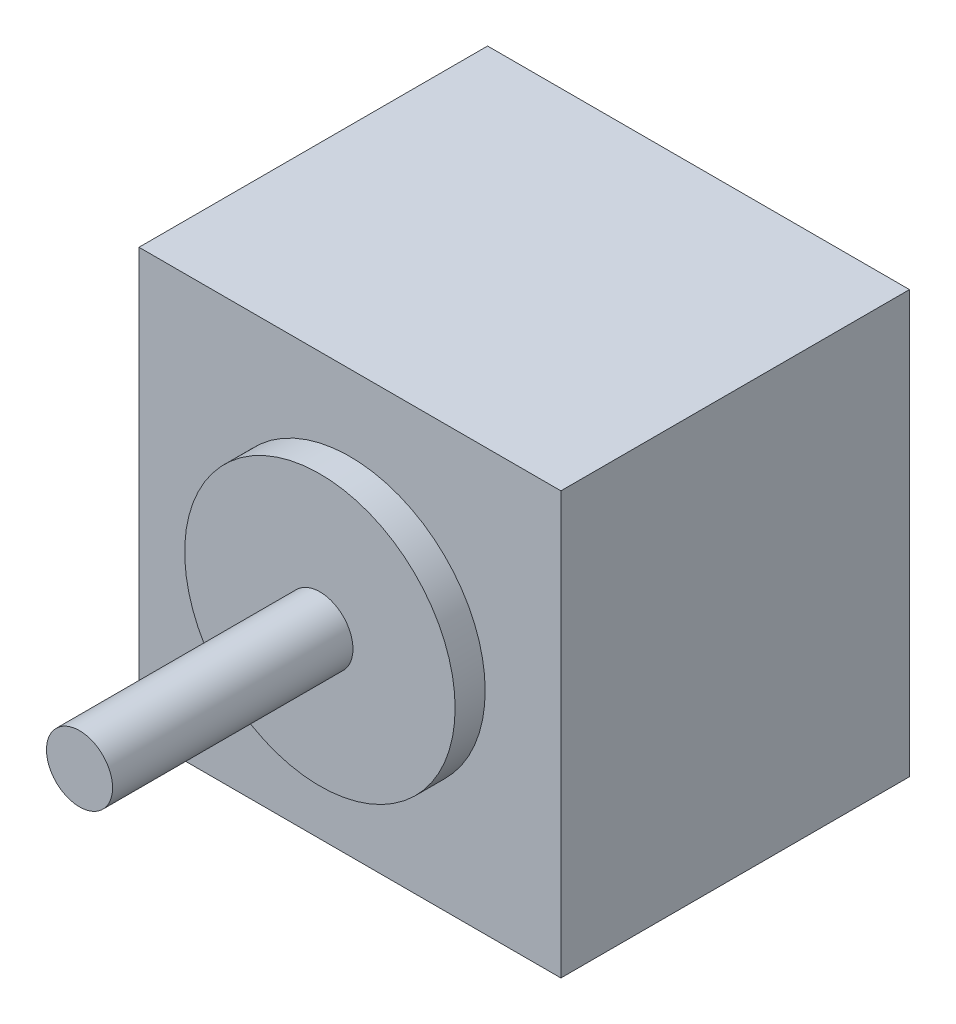
ISO-10303-21;
HEADER;
FILE_DESCRIPTION(('STEP AP214'),'2;1');
FILE_NAME('part.step','',(''),(''),'','','');
FILE_SCHEMA(('AUTOMOTIVE_DESIGN { 1 0 10303 214 1 1 1 1 }'));
ENDSEC;
DATA;
#1=APPLICATION_CONTEXT('core data for automotive mechanical design processes');
#2=APPLICATION_PROTOCOL_DEFINITION('international standard','automotive_design',2000,#1);
#3=PRODUCT_CONTEXT('',#1,'mechanical');
#4=PRODUCT('Part','Part','',(#3));
#5=PRODUCT_RELATED_PRODUCT_CATEGORY('part','',(#4));
#6=PRODUCT_DEFINITION_FORMATION('','',#4);
#7=PRODUCT_DEFINITION_CONTEXT('part definition',#1,'design');
#8=PRODUCT_DEFINITION('design','',#6,#7);
#9=PRODUCT_DEFINITION_SHAPE('','',#8);
#10=(LENGTH_UNIT() NAMED_UNIT(*) SI_UNIT(.MILLI.,.METRE.));
#11=(NAMED_UNIT(*) PLANE_ANGLE_UNIT() SI_UNIT($,.RADIAN.));
#12=(NAMED_UNIT(*) SI_UNIT($,.STERADIAN.) SOLID_ANGLE_UNIT());
#13=UNCERTAINTY_MEASURE_WITH_UNIT(LENGTH_MEASURE(1.E-05),#10,'distance_accuracy_value','');
#14=(GEOMETRIC_REPRESENTATION_CONTEXT(3) GLOBAL_UNCERTAINTY_ASSIGNED_CONTEXT((#13)) GLOBAL_UNIT_ASSIGNED_CONTEXT((#10,
#11,#12)) REPRESENTATION_CONTEXT('',''));
#15=CARTESIAN_POINT('',(0.,0.,0.));
#16=DIRECTION('',(0.,0.,1.));
#17=DIRECTION('',(1.,0.,0.));
#18=AXIS2_PLACEMENT_3D('',#15,#16,#17);
#19=CARTESIAN_POINT('',(-13.1625,8.55,29.));
#20=DIRECTION('',(1.,0.,0.));
#21=DIRECTION('',(0.,1.,0.));
#22=AXIS2_PLACEMENT_3D('',#19,#20,#21);
#23=PLANE('',#22);
#24=DIRECTION('',(0.,-1.,0.));
#25=VECTOR('',#24,1.);
#26=CARTESIAN_POINT('',(-13.1625,8.55,0.));
#27=LINE('',#26,#25);
#28=CARTESIAN_POINT('',(-13.1625,8.55,0.));
#29=VERTEX_POINT('',#28);
#30=CARTESIAN_POINT('',(-13.1625,-26.55,0.));
#31=VERTEX_POINT('',#30);
#32=EDGE_CURVE('E100',#29,#31,#27,.T.);
#33=ORIENTED_EDGE('',*,*,#32,.T.);
#34=DIRECTION('',(0.,0.,-1.));
#35=VECTOR('',#34,1.);
#36=CARTESIAN_POINT('',(-13.1625,-26.55,29.));
#37=LINE('',#36,#35);
#38=CARTESIAN_POINT('',(-13.1625,-26.55,29.));
#39=VERTEX_POINT('',#38);
#40=EDGE_CURVE('E36',#39,#31,#37,.T.);
#41=ORIENTED_EDGE('',*,*,#40,.F.);
#42=DIRECTION('',(0.,-1.,0.));
#43=VECTOR('',#42,1.);
#44=CARTESIAN_POINT('',(-13.1625,8.55,29.));
#45=LINE('',#44,#43);
#46=CARTESIAN_POINT('',(-13.1625,8.55,29.));
#47=VERTEX_POINT('',#46);
#48=EDGE_CURVE('E85',#47,#39,#45,.T.);
#49=ORIENTED_EDGE('',*,*,#48,.F.);
#50=DIRECTION('',(0.,0.,-1.));
#51=VECTOR('',#50,1.);
#52=CARTESIAN_POINT('',(-13.1625,8.55,29.));
#53=LINE('',#52,#51);
#54=EDGE_CURVE('E51',#47,#29,#53,.T.);
#55=ORIENTED_EDGE('',*,*,#54,.T.);
#56=EDGE_LOOP('',(#33,#41,#49,#55));
#57=FACE_BOUND('',#56,.T.);
#58=ADVANCED_FACE('F33',(#57),#23,.F.);
#59=CARTESIAN_POINT('',(-13.1625,-26.55,29.));
#60=DIRECTION('',(0.,1.,0.));
#61=DIRECTION('',(0.,0.,1.));
#62=AXIS2_PLACEMENT_3D('',#59,#60,#61);
#63=PLANE('',#62);
#64=DIRECTION('',(1.,0.,0.));
#65=VECTOR('',#64,1.);
#66=CARTESIAN_POINT('',(-13.1625,-26.55,0.));
#67=LINE('',#66,#65);
#68=CARTESIAN_POINT('',(21.9375,-26.55,0.));
#69=VERTEX_POINT('',#68);
#70=EDGE_CURVE('E91',#31,#69,#67,.T.);
#71=ORIENTED_EDGE('',*,*,#70,.T.);
#72=DIRECTION('',(0.,0.,-1.));
#73=VECTOR('',#72,1.);
#74=CARTESIAN_POINT('',(21.9375,-26.55,29.));
#75=LINE('',#74,#73);
#76=CARTESIAN_POINT('',(21.9375,-26.55,29.));
#77=VERTEX_POINT('',#76);
#78=EDGE_CURVE('E89',#77,#69,#75,.T.);
#79=ORIENTED_EDGE('',*,*,#78,.F.);
#80=DIRECTION('',(1.,0.,0.));
#81=VECTOR('',#80,1.);
#82=CARTESIAN_POINT('',(-13.1625,-26.55,29.));
#83=LINE('',#82,#81);
#84=EDGE_CURVE('E77',#39,#77,#83,.T.);
#85=ORIENTED_EDGE('',*,*,#84,.F.);
#86=ORIENTED_EDGE('',*,*,#40,.T.);
#87=EDGE_LOOP('',(#71,#79,#85,#86));
#88=FACE_BOUND('',#87,.T.);
#89=ADVANCED_FACE('F90',(#88),#63,.F.);
#90=CARTESIAN_POINT('',(21.9375,8.55,29.));
#91=DIRECTION('',(1.,0.,0.));
#92=DIRECTION('',(0.,0.,-1.));
#93=AXIS2_PLACEMENT_3D('',#90,#91,#92);
#94=PLANE('',#93);
#95=DIRECTION('',(0.,-1.,0.));
#96=VECTOR('',#95,1.);
#97=CARTESIAN_POINT('',(21.9375,8.55,0.));
#98=LINE('',#97,#96);
#99=CARTESIAN_POINT('',(21.9375,8.55,0.));
#100=VERTEX_POINT('',#99);
#101=EDGE_CURVE('E104',#100,#69,#98,.T.);
#102=ORIENTED_EDGE('',*,*,#101,.F.);
#103=DIRECTION('',(0.,0.,-1.));
#104=VECTOR('',#103,1.);
#105=CARTESIAN_POINT('',(21.9375,8.55,29.));
#106=LINE('',#105,#104);
#107=CARTESIAN_POINT('',(21.9375,8.55,29.));
#108=VERTEX_POINT('',#107);
#109=EDGE_CURVE('E65',#108,#100,#106,.T.);
#110=ORIENTED_EDGE('',*,*,#109,.F.);
#111=DIRECTION('',(0.,-1.,0.));
#112=VECTOR('',#111,1.);
#113=CARTESIAN_POINT('',(21.9375,8.55,29.));
#114=LINE('',#113,#112);
#115=EDGE_CURVE('E84',#108,#77,#114,.T.);
#116=ORIENTED_EDGE('',*,*,#115,.T.);
#117=ORIENTED_EDGE('',*,*,#78,.T.);
#118=EDGE_LOOP('',(#102,#110,#116,#117));
#119=FACE_BOUND('',#118,.T.);
#120=ADVANCED_FACE('F94',(#119),#94,.T.);
#121=CARTESIAN_POINT('',(-13.1625,8.55,29.));
#122=DIRECTION('',(0.,1.,0.));
#123=DIRECTION('',(0.,0.,1.));
#124=AXIS2_PLACEMENT_3D('',#121,#122,#123);
#125=PLANE('',#124);
#126=DIRECTION('',(1.,0.,0.));
#127=VECTOR('',#126,1.);
#128=CARTESIAN_POINT('',(-13.1625,8.55,0.));
#129=LINE('',#128,#127);
#130=EDGE_CURVE('E106',#29,#100,#129,.T.);
#131=ORIENTED_EDGE('',*,*,#130,.F.);
#132=ORIENTED_EDGE('',*,*,#54,.F.);
#133=DIRECTION('',(1.,0.,0.));
#134=VECTOR('',#133,1.);
#135=CARTESIAN_POINT('',(-13.1625,8.55,29.));
#136=LINE('',#135,#134);
#137=EDGE_CURVE('E95',#47,#108,#136,.T.);
#138=ORIENTED_EDGE('',*,*,#137,.T.);
#139=ORIENTED_EDGE('',*,*,#109,.T.);
#140=EDGE_LOOP('',(#131,#132,#138,#139));
#141=FACE_BOUND('',#140,.T.);
#142=ADVANCED_FACE('F142',(#141),#125,.T.);
#143=CARTESIAN_POINT('',(0.,0.,29.));
#144=DIRECTION('',(0.,0.,1.));
#145=DIRECTION('',(1.,0.,0.));
#146=AXIS2_PLACEMENT_3D('',#143,#144,#145);
#147=PLANE('',#146);
#148=CARTESIAN_POINT('',(4.38750000000002,-9.,29.));
#149=DIRECTION('',(0.,0.,1.));
#150=DIRECTION('',(1.,0.,0.));
#151=AXIS2_PLACEMENT_3D('',#148,#149,#150);
#152=CIRCLE('',#151,11.25);
#153=CARTESIAN_POINT('',(15.6375,-9.,29.));
#154=VERTEX_POINT('',#153);
#155=EDGE_CURVE('E42',#154,#154,#152,.T.);
#156=ORIENTED_EDGE('',*,*,#155,.F.);
#157=EDGE_LOOP('',(#156));
#158=FACE_BOUND('',#157,.T.);
#159=ORIENTED_EDGE('',*,*,#48,.T.);
#160=ORIENTED_EDGE('',*,*,#84,.T.);
#161=ORIENTED_EDGE('',*,*,#115,.F.);
#162=ORIENTED_EDGE('',*,*,#137,.F.);
#163=EDGE_LOOP('',(#159,#160,#161,#162));
#164=FACE_BOUND('',#163,.T.);
#165=ADVANCED_FACE('F81',(#158,#164),#147,.T.);
#166=CARTESIAN_POINT('',(0.,0.,0.));
#167=DIRECTION('',(0.,0.,1.));
#168=DIRECTION('',(1.,0.,0.));
#169=AXIS2_PLACEMENT_3D('',#166,#167,#168);
#170=PLANE('',#169);
#171=ORIENTED_EDGE('',*,*,#32,.F.);
#172=ORIENTED_EDGE('',*,*,#130,.T.);
#173=ORIENTED_EDGE('',*,*,#101,.T.);
#174=ORIENTED_EDGE('',*,*,#70,.F.);
#175=EDGE_LOOP('',(#171,#172,#173,#174));
#176=FACE_BOUND('',#175,.T.);
#177=ADVANCED_FACE('F137',(#176),#170,.F.);
#178=CARTESIAN_POINT('',(4.38750000000002,-9.,31.5));
#179=DIRECTION('',(0.,0.,-1.));
#180=DIRECTION('',(-1.,0.,0.));
#181=AXIS2_PLACEMENT_3D('',#178,#179,#180);
#182=CYLINDRICAL_SURFACE('',#181,11.25);
#183=CARTESIAN_POINT('',(4.38750000000002,-9.,31.5));
#184=DIRECTION('',(0.,0.,1.));
#185=DIRECTION('',(1.,0.,0.));
#186=AXIS2_PLACEMENT_3D('',#183,#184,#185);
#187=CIRCLE('',#186,11.25);
#188=CARTESIAN_POINT('',(15.6375,-9.,31.5));
#189=VERTEX_POINT('',#188);
#190=EDGE_CURVE('E102',#189,#189,#187,.T.);
#191=ORIENTED_EDGE('',*,*,#190,.F.);
#192=EDGE_LOOP('',(#191));
#193=FACE_BOUND('',#192,.T.);
#194=ORIENTED_EDGE('',*,*,#155,.T.);
#195=EDGE_LOOP('',(#194));
#196=FACE_BOUND('',#195,.T.);
#197=ADVANCED_FACE('F131',(#193,#196),#182,.T.);
#198=CARTESIAN_POINT('',(4.38750000000002,-9.,31.5));
#199=DIRECTION('',(0.,0.,1.));
#200=DIRECTION('',(1.,0.,0.));
#201=AXIS2_PLACEMENT_3D('',#198,#199,#200);
#202=PLANE('',#201);
#203=CARTESIAN_POINT('',(4.38750000000002,-9.,31.5));
#204=DIRECTION('',(0.,0.,1.));
#205=DIRECTION('',(1.,0.,0.));
#206=AXIS2_PLACEMENT_3D('',#203,#204,#205);
#207=CIRCLE('',#206,2.75);
#208=CARTESIAN_POINT('',(7.13750000000002,-9.,31.5));
#209=VERTEX_POINT('',#208);
#210=EDGE_CURVE('E11',#209,#209,#207,.T.);
#211=ORIENTED_EDGE('',*,*,#210,.F.);
#212=EDGE_LOOP('',(#211));
#213=FACE_BOUND('',#212,.T.);
#214=ORIENTED_EDGE('',*,*,#190,.T.);
#215=EDGE_LOOP('',(#214));
#216=FACE_BOUND('',#215,.T.);
#217=ADVANCED_FACE('F125',(#213,#216),#202,.T.);
#218=CARTESIAN_POINT('',(4.38750000000002,-9.,51.5));
#219=DIRECTION('',(0.,0.,-1.));
#220=DIRECTION('',(-1.,0.,0.));
#221=AXIS2_PLACEMENT_3D('',#218,#219,#220);
#222=CYLINDRICAL_SURFACE('',#221,2.75);
#223=CARTESIAN_POINT('',(4.38750000000002,-9.,51.5));
#224=DIRECTION('',(0.,0.,1.));
#225=DIRECTION('',(1.,0.,0.));
#226=AXIS2_PLACEMENT_3D('',#223,#224,#225);
#227=CIRCLE('',#226,2.75);
#228=CARTESIAN_POINT('',(7.13750000000002,-9.,51.5));
#229=VERTEX_POINT('',#228);
#230=EDGE_CURVE('E115',#229,#229,#227,.T.);
#231=ORIENTED_EDGE('',*,*,#230,.F.);
#232=EDGE_LOOP('',(#231));
#233=FACE_BOUND('',#232,.T.);
#234=ORIENTED_EDGE('',*,*,#210,.T.);
#235=EDGE_LOOP('',(#234));
#236=FACE_BOUND('',#235,.T.);
#237=ADVANCED_FACE('F122',(#233,#236),#222,.T.);
#238=CARTESIAN_POINT('',(4.38750000000002,-9.,51.5));
#239=DIRECTION('',(0.,0.,1.));
#240=DIRECTION('',(1.,0.,0.));
#241=AXIS2_PLACEMENT_3D('',#238,#239,#240);
#242=PLANE('',#241);
#243=ORIENTED_EDGE('',*,*,#230,.T.);
#244=EDGE_LOOP('',(#243));
#245=FACE_BOUND('',#244,.T.);
#246=ADVANCED_FACE('F120',(#245),#242,.T.);
#247=CLOSED_SHELL('',(#58,#89,#120,#142,#165,#177,#197,#217,#237,#246));
#248=MANIFOLD_SOLID_BREP('B2',#247);
#249=ADVANCED_BREP_SHAPE_REPRESENTATION('',(#18,#248),#14);
#250=SHAPE_DEFINITION_REPRESENTATION(#9,#249);
ENDSEC;
END-ISO-10303-21;
